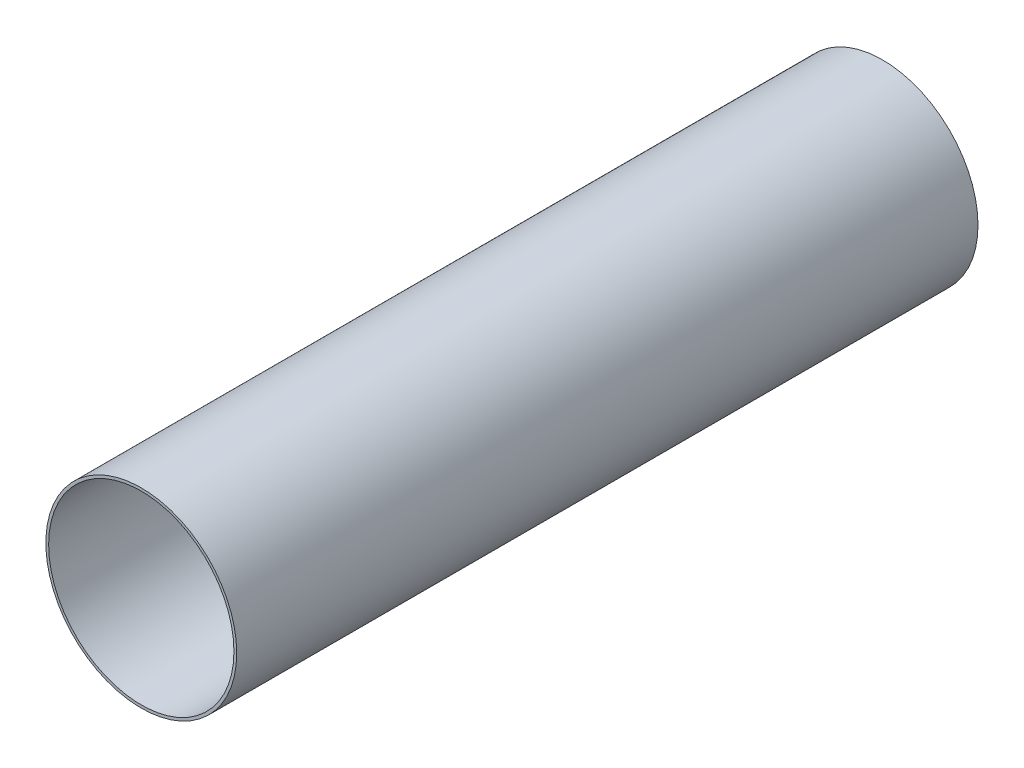
ISO-10303-21;
HEADER;
FILE_DESCRIPTION(('STEP AP214'),'2;1');
FILE_NAME('part.step','',(''),(''),'','','');
FILE_SCHEMA(('AUTOMOTIVE_DESIGN { 1 0 10303 214 1 1 1 1 }'));
ENDSEC;
DATA;
#1=APPLICATION_CONTEXT('core data for automotive mechanical design processes');
#2=APPLICATION_PROTOCOL_DEFINITION('international standard','automotive_design',2000,#1);
#3=PRODUCT_CONTEXT('',#1,'mechanical');
#4=PRODUCT('Part','Part','',(#3));
#5=PRODUCT_RELATED_PRODUCT_CATEGORY('part','',(#4));
#6=PRODUCT_DEFINITION_FORMATION('','',#4);
#7=PRODUCT_DEFINITION_CONTEXT('part definition',#1,'design');
#8=PRODUCT_DEFINITION('design','',#6,#7);
#9=PRODUCT_DEFINITION_SHAPE('','',#8);
#10=(LENGTH_UNIT() NAMED_UNIT(*) SI_UNIT(.MILLI.,.METRE.));
#11=(NAMED_UNIT(*) PLANE_ANGLE_UNIT() SI_UNIT($,.RADIAN.));
#12=(NAMED_UNIT(*) SI_UNIT($,.STERADIAN.) SOLID_ANGLE_UNIT());
#13=UNCERTAINTY_MEASURE_WITH_UNIT(LENGTH_MEASURE(1.E-05),#10,'distance_accuracy_value','');
#14=(GEOMETRIC_REPRESENTATION_CONTEXT(3) GLOBAL_UNCERTAINTY_ASSIGNED_CONTEXT((#13)) GLOBAL_UNIT_ASSIGNED_CONTEXT((#10,
#11,#12)) REPRESENTATION_CONTEXT('',''));
#15=CARTESIAN_POINT('',(0.,0.,0.));
#16=DIRECTION('',(0.,0.,1.));
#17=DIRECTION('',(1.,0.,0.));
#18=AXIS2_PLACEMENT_3D('',#15,#16,#17);
#19=CARTESIAN_POINT('',(0.,0.,254.));
#20=DIRECTION('',(0.,0.,1.));
#21=DIRECTION('',(1.,0.,0.));
#22=AXIS2_PLACEMENT_3D('',#19,#20,#21);
#23=PLANE('',#22);
#24=CARTESIAN_POINT('',(0.,0.,254.));
#25=DIRECTION('',(0.,0.,1.));
#26=DIRECTION('',(1.,0.,0.));
#27=AXIS2_PLACEMENT_3D('',#24,#25,#26);
#28=CIRCLE('',#27,65.405);
#29=CARTESIAN_POINT('',(65.405,0.,254.));
#30=VERTEX_POINT('',#29);
#31=EDGE_CURVE('E10',#30,#30,#28,.T.);
#32=ORIENTED_EDGE('',*,*,#31,.T.);
#33=EDGE_LOOP('',(#32));
#34=FACE_BOUND('',#33,.T.);
#35=CARTESIAN_POINT('',(0.,0.,254.));
#36=DIRECTION('',(0.,0.,1.));
#37=DIRECTION('',(1.,0.,0.));
#38=AXIS2_PLACEMENT_3D('',#35,#36,#37);
#39=CIRCLE('',#38,63.5);
#40=CARTESIAN_POINT('',(63.5,0.,254.));
#41=VERTEX_POINT('',#40);
#42=EDGE_CURVE('E54',#41,#41,#39,.T.);
#43=ORIENTED_EDGE('',*,*,#42,.F.);
#44=EDGE_LOOP('',(#43));
#45=FACE_BOUND('',#44,.T.);
#46=ADVANCED_FACE('F43',(#34,#45),#23,.T.);
#47=CARTESIAN_POINT('',(0.,0.,-254.));
#48=DIRECTION('',(0.,0.,1.));
#49=DIRECTION('',(1.,0.,0.));
#50=AXIS2_PLACEMENT_3D('',#47,#48,#49);
#51=PLANE('',#50);
#52=CARTESIAN_POINT('',(0.,0.,-254.));
#53=DIRECTION('',(0.,0.,1.));
#54=DIRECTION('',(1.,0.,0.));
#55=AXIS2_PLACEMENT_3D('',#52,#53,#54);
#56=CIRCLE('',#55,65.405);
#57=CARTESIAN_POINT('',(65.405,0.,-254.));
#58=VERTEX_POINT('',#57);
#59=EDGE_CURVE('E47',#58,#58,#56,.T.);
#60=ORIENTED_EDGE('',*,*,#59,.F.);
#61=EDGE_LOOP('',(#60));
#62=FACE_BOUND('',#61,.T.);
#63=CARTESIAN_POINT('',(0.,0.,-254.));
#64=DIRECTION('',(0.,0.,1.));
#65=DIRECTION('',(1.,0.,0.));
#66=AXIS2_PLACEMENT_3D('',#63,#64,#65);
#67=CIRCLE('',#66,63.5);
#68=CARTESIAN_POINT('',(63.5,0.,-254.));
#69=VERTEX_POINT('',#68);
#70=EDGE_CURVE('E56',#69,#69,#67,.T.);
#71=ORIENTED_EDGE('',*,*,#70,.T.);
#72=EDGE_LOOP('',(#71));
#73=FACE_BOUND('',#72,.T.);
#74=ADVANCED_FACE('F66',(#62,#73),#51,.F.);
#75=CARTESIAN_POINT('',(0.,0.,254.));
#76=DIRECTION('',(0.,0.,-1.));
#77=DIRECTION('',(-1.,0.,0.));
#78=AXIS2_PLACEMENT_3D('',#75,#76,#77);
#79=CYLINDRICAL_SURFACE('',#78,65.405);
#80=ORIENTED_EDGE('',*,*,#31,.F.);
#81=EDGE_LOOP('',(#80));
#82=FACE_BOUND('',#81,.T.);
#83=ORIENTED_EDGE('',*,*,#59,.T.);
#84=EDGE_LOOP('',(#83));
#85=FACE_BOUND('',#84,.T.);
#86=ADVANCED_FACE('F45',(#82,#85),#79,.T.);
#87=CARTESIAN_POINT('',(0.,0.,254.));
#88=DIRECTION('',(0.,0.,-1.));
#89=DIRECTION('',(-1.,0.,0.));
#90=AXIS2_PLACEMENT_3D('',#87,#88,#89);
#91=CYLINDRICAL_SURFACE('',#90,63.5);
#92=ORIENTED_EDGE('',*,*,#42,.T.);
#93=EDGE_LOOP('',(#92));
#94=FACE_BOUND('',#93,.T.);
#95=ORIENTED_EDGE('',*,*,#70,.F.);
#96=EDGE_LOOP('',(#95));
#97=FACE_BOUND('',#96,.T.);
#98=ADVANCED_FACE('F62',(#94,#97),#91,.F.);
#99=CLOSED_SHELL('',(#46,#74,#86,#98));
#100=MANIFOLD_SOLID_BREP('B2',#99);
#101=ADVANCED_BREP_SHAPE_REPRESENTATION('',(#18,#100),#14);
#102=SHAPE_DEFINITION_REPRESENTATION(#9,#101);
ENDSEC;
END-ISO-10303-21;
